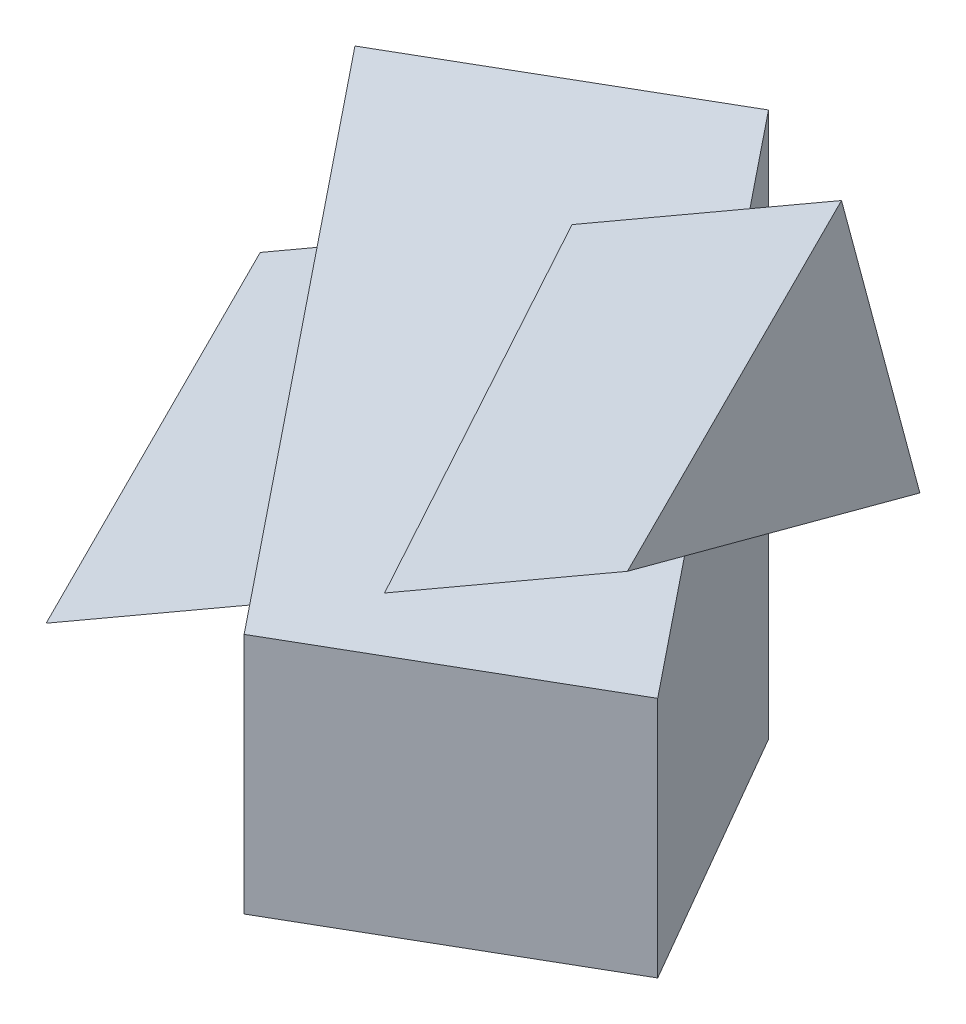
ISO-10303-21;
HEADER;
FILE_DESCRIPTION(('STEP AP214'),'2;1');
FILE_NAME('part.step','',(''),(''),'','','');
FILE_SCHEMA(('AUTOMOTIVE_DESIGN { 1 0 10303 214 1 1 1 1 }'));
ENDSEC;
DATA;
#1=APPLICATION_CONTEXT('core data for automotive mechanical design processes');
#2=APPLICATION_PROTOCOL_DEFINITION('international standard','automotive_design',2000,#1);
#3=PRODUCT_CONTEXT('',#1,'mechanical');
#4=PRODUCT('Part','Part','',(#3));
#5=PRODUCT_RELATED_PRODUCT_CATEGORY('part','',(#4));
#6=PRODUCT_DEFINITION_FORMATION('','',#4);
#7=PRODUCT_DEFINITION_CONTEXT('part definition',#1,'design');
#8=PRODUCT_DEFINITION('design','',#6,#7);
#9=PRODUCT_DEFINITION_SHAPE('','',#8);
#10=(LENGTH_UNIT() NAMED_UNIT(*) SI_UNIT(.MILLI.,.METRE.));
#11=(NAMED_UNIT(*) PLANE_ANGLE_UNIT() SI_UNIT($,.RADIAN.));
#12=(NAMED_UNIT(*) SI_UNIT($,.STERADIAN.) SOLID_ANGLE_UNIT());
#13=UNCERTAINTY_MEASURE_WITH_UNIT(LENGTH_MEASURE(1.E-05),#10,'distance_accuracy_value','');
#14=(GEOMETRIC_REPRESENTATION_CONTEXT(3) GLOBAL_UNCERTAINTY_ASSIGNED_CONTEXT((#13)) GLOBAL_UNIT_ASSIGNED_CONTEXT((#10,
#11,#12)) REPRESENTATION_CONTEXT('',''));
#15=CARTESIAN_POINT('',(0.,0.,0.));
#16=DIRECTION('',(0.,0.,1.));
#17=DIRECTION('',(1.,0.,0.));
#18=AXIS2_PLACEMENT_3D('',#15,#16,#17);
#19=CARTESIAN_POINT('',(63.3012701892223,90.,0.));
#20=DIRECTION('',(-0.866025403784445,0.,0.499999999999989));
#21=DIRECTION('',(0.499999999999989,0.,0.866025403784445));
#22=AXIS2_PLACEMENT_3D('',#19,#20,#21);
#23=PLANE('',#22);
#24=DIRECTION('',(-0.443476552470608,-0.461859491225528,-0.768123920844599));
#25=VECTOR('',#24,1.);
#26=CARTESIAN_POINT('',(74.6725165198079,46.325408780915,19.6955763899561));
#27=LINE('',#26,#25);
#28=CARTESIAN_POINT('',(81.5547883274849,53.4929637234735,31.6160208323519));
#29=VERTEX_POINT('',#28);
#30=CARTESIAN_POINT('',(67.7490084725809,39.1149082789746,7.70370868554658));
#31=VERTEX_POINT('',#30);
#32=EDGE_CURVE('E144',#29,#31,#27,.T.);
#33=ORIENTED_EDGE('',*,*,#32,.F.);
#34=DIRECTION('',(0.353553390593266,-0.707106781186548,0.612372435695799));
#35=VECTOR('',#34,1.);
#36=CARTESIAN_POINT('',(63.3012701892222,89.9999999999998,-1.44901625366124E-13));
#37=LINE('',#36,#35);
#38=CARTESIAN_POINT('',(88.3012701892215,40.,43.3012701892219));
#39=VERTEX_POINT('',#38);
#40=EDGE_CURVE('E169',#29,#39,#37,.T.);
#41=ORIENTED_EDGE('',*,*,#40,.T.);
#42=DIRECTION('',(0.,-1.,0.));
#43=VECTOR('',#42,1.);
#44=CARTESIAN_POINT('',(88.3012701892217,90.,43.3012701892223));
#45=LINE('',#44,#43);
#46=CARTESIAN_POINT('',(88.3012701892217,0.,43.3012701892223));
#47=VERTEX_POINT('',#46);
#48=EDGE_CURVE('E175',#39,#47,#45,.T.);
#49=ORIENTED_EDGE('',*,*,#48,.T.);
#50=DIRECTION('',(-0.499999999999989,0.,-0.866025403784445));
#51=VECTOR('',#50,1.);
#52=CARTESIAN_POINT('',(63.3012701892223,0.,0.));
#53=LINE('',#52,#51);
#54=CARTESIAN_POINT('',(63.3012701892223,0.,0.));
#55=VERTEX_POINT('',#54);
#56=EDGE_CURVE('E172',#47,#55,#53,.T.);
#57=ORIENTED_EDGE('',*,*,#56,.T.);
#58=DIRECTION('',(0.,-1.,0.));
#59=VECTOR('',#58,1.);
#60=CARTESIAN_POINT('',(63.3012701892223,90.,0.));
#61=LINE('',#60,#59);
#62=CARTESIAN_POINT('',(63.3012701892223,90.,0.));
#63=VERTEX_POINT('',#62);
#64=EDGE_CURVE('E193',#63,#55,#61,.T.);
#65=ORIENTED_EDGE('',*,*,#64,.F.);
#66=CARTESIAN_POINT('',(72.3931315284246,71.8162773215945,15.7475657748702));
#67=VERTEX_POINT('',#66);
#68=EDGE_CURVE('E170',#63,#67,#37,.T.);
#69=ORIENTED_EDGE('',*,*,#68,.T.);
#70=DIRECTION('',(0.136612474868475,0.961950168585274,0.236619747419932));
#71=VECTOR('',#70,1.);
#72=CARTESIAN_POINT('',(74.1040099314093,83.8633452761459,18.710894094412));
#73=LINE('',#72,#71);
#74=EDGE_CURVE('E47',#31,#67,#73,.T.);
#75=ORIENTED_EDGE('',*,*,#74,.F.);
#76=EDGE_LOOP('',(#33,#41,#49,#57,#65,#69,#75));
#77=FACE_BOUND('',#76,.T.);
#78=ADVANCED_FACE('F33',(#77),#23,.F.);
#79=CARTESIAN_POINT('',(63.3012701892223,90.,0.));
#80=DIRECTION('',(0.499999999999989,0.,0.866025403784445));
#81=DIRECTION('',(0.866025403784445,0.,-0.499999999999989));
#82=AXIS2_PLACEMENT_3D('',#79,#80,#81);
#83=PLANE('',#82);
#84=DIRECTION('',(-0.813259170127467,-0.343723769333444,0.469535400794011));
#85=VECTOR('',#84,1.);
#86=CARTESIAN_POINT('',(78.8203535776659,41.0419392793252,-8.95994697189392));
#87=LINE('',#86,#85);
#88=CARTESIAN_POINT('',(49.9580553391456,28.8432966982458,7.70370868554658));
#89=VERTEX_POINT('',#88);
#90=CARTESIAN_POINT('',(20.,16.1815326735535,24.9999999999995));
#91=VERTEX_POINT('',#90);
#92=EDGE_CURVE('E55',#89,#91,#87,.T.);
#93=ORIENTED_EDGE('',*,*,#92,.F.);
#94=DIRECTION('',(0.511552974070653,-0.806898221355063,-0.295345247284436));
#95=VECTOR('',#94,1.);
#96=CARTESIAN_POINT('',(29.3699817359462,61.3179001383467,19.5902385224492));
#97=LINE('',#96,#95);
#98=CARTESIAN_POINT('',(27.5436685349435,64.1986357575728,20.6446609406727));
#99=VERTEX_POINT('',#98);
#100=EDGE_CURVE('E157',#99,#89,#97,.T.);
#101=ORIENTED_EDGE('',*,*,#100,.F.);
#102=DIRECTION('',(0.612372435695802,0.707106781186544,-0.353553390593268));
#103=VECTOR('',#102,1.);
#104=CARTESIAN_POINT('',(56.5947878052018,97.7439788194594,3.87198940972958));
#105=LINE('',#104,#103);
#106=CARTESIAN_POINT('',(20.,55.4879576389191,24.9999999999995));
#107=VERTEX_POINT('',#106);
#108=EDGE_CURVE('E149',#107,#99,#105,.T.);
#109=ORIENTED_EDGE('',*,*,#108,.F.);
#110=DIRECTION('',(0.,-1.,0.));
#111=VECTOR('',#110,1.);
#112=CARTESIAN_POINT('',(20.,90.,24.9999999999995));
#113=LINE('',#112,#111);
#114=CARTESIAN_POINT('',(20.0000000000002,90.,24.9999999999993));
#115=VERTEX_POINT('',#114);
#116=EDGE_CURVE('E191',#115,#107,#113,.T.);
#117=ORIENTED_EDGE('',*,*,#116,.F.);
#118=DIRECTION('',(-0.866025403784445,0.,0.499999999999989));
#119=VECTOR('',#118,1.);
#120=CARTESIAN_POINT('',(63.3012701892223,90.,0.));
#121=LINE('',#120,#119);
#122=EDGE_CURVE('E173',#63,#115,#121,.T.);
#123=ORIENTED_EDGE('',*,*,#122,.F.);
#124=ORIENTED_EDGE('',*,*,#64,.T.);
#125=DIRECTION('',(-0.866025403784445,0.,0.499999999999989));
#126=VECTOR('',#125,1.);
#127=CARTESIAN_POINT('',(63.3012701892223,0.,0.));
#128=LINE('',#127,#126);
#129=CARTESIAN_POINT('',(20.,0.,24.9999999999995));
#130=VERTEX_POINT('',#129);
#131=EDGE_CURVE('E179',#55,#130,#128,.T.);
#132=ORIENTED_EDGE('',*,*,#131,.T.);
#133=EDGE_CURVE('E190',#91,#130,#113,.T.);
#134=ORIENTED_EDGE('',*,*,#133,.F.);
#135=EDGE_LOOP('',(#93,#101,#109,#117,#123,#124,#132,#134));
#136=FACE_BOUND('',#135,.T.);
#137=ADVANCED_FACE('F227',(#136),#83,.F.);
#138=CARTESIAN_POINT('',(20.,90.,24.9999999999995));
#139=DIRECTION('',(0.866025403784445,0.,-0.499999999999989));
#140=DIRECTION('',(-0.499999999999989,0.,-0.866025403784445));
#141=AXIS2_PLACEMENT_3D('',#138,#139,#140);
#142=PLANE('',#141);
#143=DIRECTION('',(0.443476552470607,0.461859491225528,0.7681239208446));
#144=VECTOR('',#143,1.);
#145=CARTESIAN_POINT('',(35.1197830402084,31.9280592113999,51.1882324250594));
#146=LINE('',#145,#144);
#147=CARTESIAN_POINT('',(37.8978583448782,34.8212909722516,56.));
#148=VERTEX_POINT('',#147);
#149=EDGE_CURVE('E160',#91,#148,#146,.T.);
#150=ORIENTED_EDGE('',*,*,#149,.F.);
#151=ORIENTED_EDGE('',*,*,#133,.T.);
#152=DIRECTION('',(0.499999999999989,0.,0.866025403784445));
#153=VECTOR('',#152,1.);
#154=CARTESIAN_POINT('',(20.,0.,24.9999999999995));
#155=LINE('',#154,#153);
#156=CARTESIAN_POINT('',(44.9999999999994,0.,68.3012701892217));
#157=VERTEX_POINT('',#156);
#158=EDGE_CURVE('E182',#130,#157,#155,.T.);
#159=ORIENTED_EDGE('',*,*,#158,.T.);
#160=DIRECTION('',(0.,-1.,0.));
#161=VECTOR('',#160,1.);
#162=CARTESIAN_POINT('',(44.9999999999994,90.,68.3012701892217));
#163=LINE('',#162,#161);
#164=CARTESIAN_POINT('',(45.,40.,68.3012701892214));
#165=VERTEX_POINT('',#164);
#166=EDGE_CURVE('E188',#165,#157,#163,.T.);
#167=ORIENTED_EDGE('',*,*,#166,.F.);
#168=DIRECTION('',(0.35355339059327,-0.707106781186547,0.612372435695796));
#169=VECTOR('',#168,1.);
#170=CARTESIAN_POINT('',(45.,40.,68.3012701892214));
#171=LINE('',#170,#169);
#172=EDGE_CURVE('E164',#115,#165,#171,.T.);
#173=ORIENTED_EDGE('',*,*,#172,.F.);
#174=ORIENTED_EDGE('',*,*,#116,.T.);
#175=DIRECTION('',(-0.433012701892207,0.50000000000001,-0.75));
#176=VECTOR('',#175,1.);
#177=CARTESIAN_POINT('',(12.5279236447049,64.1159682291896,12.0579841145938));
#178=LINE('',#177,#176);
#179=EDGE_CURVE('E145',#148,#107,#178,.T.);
#180=ORIENTED_EDGE('',*,*,#179,.F.);
#181=EDGE_LOOP('',(#150,#151,#159,#167,#173,#174,#180));
#182=FACE_BOUND('',#181,.T.);
#183=ADVANCED_FACE('F231',(#182),#142,.F.);
#184=CARTESIAN_POINT('',(107.051270189222,40.,32.4759526419166));
#185=DIRECTION('',(-0.353553390593271,-0.707106781186547,-0.612372435695796));
#186=DIRECTION('',(0.,0.654653670707978,-0.755928946018454));
#187=AXIS2_PLACEMENT_3D('',#184,#185,#186);
#188=PLANE('',#187);
#189=DIRECTION('',(0.705905608282404,0.227852886799724,-0.670656644023215));
#190=VECTOR('',#189,1.);
#191=CARTESIAN_POINT('',(91.6824018445503,56.7619644923866,21.9941234941996));
#192=LINE('',#191,#190);
#193=CARTESIAN_POINT('',(55.8892144454072,45.2086052599784,56.));
#194=VERTEX_POINT('',#193);
#195=EDGE_CURVE('E11',#194,#29,#192,.T.);
#196=ORIENTED_EDGE('',*,*,#195,.F.);
#197=DIRECTION('',(0.0907675134870607,-0.67749794402081,0.729902592366236));
#198=VECTOR('',#197,1.);
#199=CARTESIAN_POINT('',(55.0725254639018,51.3044548058982,49.4326348507639));
#200=LINE('',#199,#198);
#201=CARTESIAN_POINT('',(51.4925781702796,78.025545182332,20.6446609406727));
#202=VERTEX_POINT('',#201);
#203=EDGE_CURVE('E196',#202,#194,#200,.T.);
#204=ORIENTED_EDGE('',*,*,#203,.F.);
#205=DIRECTION('',(-0.935290880822453,0.277862098061081,0.219142927587122));
#206=VECTOR('',#205,1.);
#207=CARTESIAN_POINT('',(107.550782081473,61.3714213459028,7.50996758241808));
#208=LINE('',#207,#206);
#209=EDGE_CURVE('E40',#67,#202,#208,.T.);
#210=ORIENTED_EDGE('',*,*,#209,.F.);
#211=ORIENTED_EDGE('',*,*,#68,.F.);
#212=ORIENTED_EDGE('',*,*,#122,.T.);
#213=ORIENTED_EDGE('',*,*,#172,.T.);
#214=DIRECTION('',(-0.866025403784441,0.,0.499999999999995));
#215=VECTOR('',#214,1.);
#216=CARTESIAN_POINT('',(107.051270189222,40.,32.4759526419166));
#217=LINE('',#216,#215);
#218=EDGE_CURVE('E166',#39,#165,#217,.T.);
#219=ORIENTED_EDGE('',*,*,#218,.F.);
#220=ORIENTED_EDGE('',*,*,#40,.F.);
#221=EDGE_LOOP('',(#196,#204,#210,#211,#212,#213,#219,#220));
#222=FACE_BOUND('',#221,.T.);
#223=ADVANCED_FACE('F246',(#222),#188,.F.);
#224=CARTESIAN_POINT('',(88.3012701892217,90.,43.3012701892223));
#225=DIRECTION('',(-0.499999999999989,0.,-0.866025403784445));
#226=DIRECTION('',(-0.866025403784445,0.,0.499999999999989));
#227=AXIS2_PLACEMENT_3D('',#224,#225,#226);
#228=PLANE('',#227);
#229=ORIENTED_EDGE('',*,*,#48,.F.);
#230=ORIENTED_EDGE('',*,*,#218,.T.);
#231=ORIENTED_EDGE('',*,*,#166,.T.);
#232=DIRECTION('',(0.866025403784445,0.,-0.499999999999989));
#233=VECTOR('',#232,1.);
#234=CARTESIAN_POINT('',(88.3012701892217,0.,43.3012701892223));
#235=LINE('',#234,#233);
#236=EDGE_CURVE('E176',#157,#47,#235,.T.);
#237=ORIENTED_EDGE('',*,*,#236,.T.);
#238=EDGE_LOOP('',(#229,#230,#231,#237));
#239=FACE_BOUND('',#238,.T.);
#240=ADVANCED_FACE('F243',(#239),#228,.F.);
#241=CARTESIAN_POINT('',(0.,0.,0.));
#242=DIRECTION('',(0.,-1.,0.));
#243=DIRECTION('',(0.,0.,-1.));
#244=AXIS2_PLACEMENT_3D('',#241,#242,#243);
#245=PLANE('',#244);
#246=ORIENTED_EDGE('',*,*,#56,.F.);
#247=ORIENTED_EDGE('',*,*,#236,.F.);
#248=ORIENTED_EDGE('',*,*,#158,.F.);
#249=ORIENTED_EDGE('',*,*,#131,.F.);
#250=EDGE_LOOP('',(#246,#247,#248,#249));
#251=FACE_BOUND('',#250,.T.);
#252=ADVANCED_FACE('F240',(#251),#245,.T.);
#253=CARTESIAN_POINT('',(96.,55.4256258422038,0.));
#254=DIRECTION('',(1.,0.,0.));
#255=DIRECTION('',(0.,0.,-1.));
#256=AXIS2_PLACEMENT_3D('',#253,#254,#255);
#257=PLANE('',#256);
#258=DIRECTION('',(0.,-0.25881904510252,-0.965925826289069));
#259=VECTOR('',#258,1.);
#260=CARTESIAN_POINT('',(96.,68.3665780973298,56.));
#261=LINE('',#260,#259);
#262=CARTESIAN_POINT('',(96.,68.3665780973298,56.));
#263=VERTEX_POINT('',#262);
#264=CARTESIAN_POINT('',(96.,55.4256258422038,7.70370868554658));
#265=VERTEX_POINT('',#264);
#266=EDGE_CURVE('E134',#263,#265,#261,.T.);
#267=ORIENTED_EDGE('',*,*,#266,.T.);
#268=DIRECTION('',(0.,0.965925826289068,0.258819045102522));
#269=VECTOR('',#268,1.);
#270=CARTESIAN_POINT('',(96.,55.4256258422038,7.70370868554658));
#271=LINE('',#270,#269);
#272=CARTESIAN_POINT('',(96.,103.721917156657,20.6446609406727));
#273=VERTEX_POINT('',#272);
#274=EDGE_CURVE('E123',#265,#273,#271,.T.);
#275=ORIENTED_EDGE('',*,*,#274,.T.);
#276=DIRECTION('',(0.,-0.707106781186548,0.707106781186547));
#277=VECTOR('',#276,1.);
#278=CARTESIAN_POINT('',(96.,103.721917156657,20.6446609406727));
#279=LINE('',#278,#277);
#280=EDGE_CURVE('E133',#273,#263,#279,.T.);
#281=ORIENTED_EDGE('',*,*,#280,.T.);
#282=EDGE_LOOP('',(#267,#275,#281));
#283=FACE_BOUND('',#282,.T.);
#284=ADVANCED_FACE('F137',(#283),#257,.T.);
#285=CARTESIAN_POINT('',(96.,103.721917156657,20.6446609406727));
#286=DIRECTION('',(0.377964473009225,-0.654653670707977,-0.654653670707978));
#287=DIRECTION('',(0.,0.707106781186548,-0.707106781186547));
#288=AXIS2_PLACEMENT_3D('',#285,#286,#287);
#289=PLANE('',#288);
#290=DIRECTION('',(-0.86602540378444,-0.499999999999998,0.));
#291=VECTOR('',#290,1.);
#292=CARTESIAN_POINT('',(96.,103.721917156657,20.6446609406727));
#293=LINE('',#292,#291);
#294=EDGE_CURVE('E130',#273,#202,#293,.T.);
#295=ORIENTED_EDGE('',*,*,#294,.T.);
#296=ORIENTED_EDGE('',*,*,#203,.T.);
#297=DIRECTION('',(-0.86602540378444,-0.499999999999998,0.));
#298=VECTOR('',#297,1.);
#299=CARTESIAN_POINT('',(96.,68.3665780973298,56.));
#300=LINE('',#299,#298);
#301=EDGE_CURVE('E202',#263,#194,#300,.T.);
#302=ORIENTED_EDGE('',*,*,#301,.F.);
#303=ORIENTED_EDGE('',*,*,#280,.F.);
#304=EDGE_LOOP('',(#295,#296,#302,#303));
#305=FACE_BOUND('',#304,.T.);
#306=ADVANCED_FACE('F200',(#305),#289,.F.);
#307=CARTESIAN_POINT('',(96.,55.4256258422038,7.70370868554658));
#308=DIRECTION('',(0.14778836410782,-0.255976955402234,0.955319003127927));
#309=DIRECTION('',(0.,-0.965925826289068,-0.258819045102522));
#310=AXIS2_PLACEMENT_3D('',#307,#308,#309);
#311=PLANE('',#310);
#312=DIRECTION('',(-0.86602540378444,-0.499999999999998,0.));
#313=VECTOR('',#312,1.);
#314=CARTESIAN_POINT('',(96.,55.4256258422038,7.70370868554658));
#315=LINE('',#314,#313);
#316=EDGE_CURVE('E127',#265,#31,#315,.T.);
#317=ORIENTED_EDGE('',*,*,#316,.T.);
#318=ORIENTED_EDGE('',*,*,#74,.T.);
#319=ORIENTED_EDGE('',*,*,#209,.T.);
#320=ORIENTED_EDGE('',*,*,#294,.F.);
#321=ORIENTED_EDGE('',*,*,#274,.F.);
#322=EDGE_LOOP('',(#317,#318,#319,#320,#321));
#323=FACE_BOUND('',#322,.T.);
#324=ADVANCED_FACE('F125',(#323),#311,.F.);
#325=CARTESIAN_POINT('',(96.,68.3665780973298,56.));
#326=DIRECTION('',(-0.487058473848147,0.843610022961952,-0.226044624379455));
#327=DIRECTION('',(-0.86602540378444,-0.499999999999998,0.));
#328=AXIS2_PLACEMENT_3D('',#325,#326,#327);
#329=PLANE('',#328);
#330=ORIENTED_EDGE('',*,*,#195,.T.);
#331=ORIENTED_EDGE('',*,*,#32,.T.);
#332=ORIENTED_EDGE('',*,*,#316,.F.);
#333=ORIENTED_EDGE('',*,*,#266,.F.);
#334=ORIENTED_EDGE('',*,*,#301,.T.);
#335=EDGE_LOOP('',(#330,#331,#332,#333,#334));
#336=FACE_BOUND('',#335,.T.);
#337=ADVANCED_FACE('F143',(#336),#329,.F.);
#338=CARTESIAN_POINT('',(0.,0.,7.70370868554658));
#339=VERTEX_POINT('',#338);
#340=EDGE_CURVE('E146',#89,#339,#315,.T.);
#341=ORIENTED_EDGE('',*,*,#340,.F.);
#342=ORIENTED_EDGE('',*,*,#92,.T.);
#343=ORIENTED_EDGE('',*,*,#149,.T.);
#344=CARTESIAN_POINT('',(0.,12.940952255126,56.));
#345=VERTEX_POINT('',#344);
#346=EDGE_CURVE('E207',#148,#345,#300,.T.);
#347=ORIENTED_EDGE('',*,*,#346,.T.);
#348=DIRECTION('',(0.,-0.25881904510252,-0.965925826289069));
#349=VECTOR('',#348,1.);
#350=CARTESIAN_POINT('',(0.,12.940952255126,56.));
#351=LINE('',#350,#349);
#352=EDGE_CURVE('E212',#345,#339,#351,.T.);
#353=ORIENTED_EDGE('',*,*,#352,.T.);
#354=EDGE_LOOP('',(#341,#342,#343,#347,#353));
#355=FACE_BOUND('',#354,.T.);
#356=ADVANCED_FACE('F218',(#355),#329,.F.);
#357=CARTESIAN_POINT('',(0.,48.2962913144534,20.6446609406727));
#358=VERTEX_POINT('',#357);
#359=EDGE_CURVE('E201',#99,#358,#293,.T.);
#360=ORIENTED_EDGE('',*,*,#359,.F.);
#361=ORIENTED_EDGE('',*,*,#100,.T.);
#362=ORIENTED_EDGE('',*,*,#340,.T.);
#363=DIRECTION('',(0.,0.965925826289068,0.258819045102522));
#364=VECTOR('',#363,1.);
#365=CARTESIAN_POINT('',(0.,0.,7.70370868554658));
#366=LINE('',#365,#364);
#367=EDGE_CURVE('E210',#339,#358,#366,.T.);
#368=ORIENTED_EDGE('',*,*,#367,.T.);
#369=EDGE_LOOP('',(#360,#361,#362,#368));
#370=FACE_BOUND('',#369,.T.);
#371=ADVANCED_FACE('F225',(#370),#311,.F.);
#372=ORIENTED_EDGE('',*,*,#179,.T.);
#373=ORIENTED_EDGE('',*,*,#108,.T.);
#374=ORIENTED_EDGE('',*,*,#359,.T.);
#375=DIRECTION('',(0.,-0.707106781186548,0.707106781186547));
#376=VECTOR('',#375,1.);
#377=CARTESIAN_POINT('',(0.,48.2962913144534,20.6446609406727));
#378=LINE('',#377,#376);
#379=EDGE_CURVE('E141',#358,#345,#378,.T.);
#380=ORIENTED_EDGE('',*,*,#379,.T.);
#381=ORIENTED_EDGE('',*,*,#346,.F.);
#382=EDGE_LOOP('',(#372,#373,#374,#380,#381));
#383=FACE_BOUND('',#382,.T.);
#384=ADVANCED_FACE('F229',(#383),#289,.F.);
#385=CARTESIAN_POINT('',(0.,0.,0.));
#386=DIRECTION('',(1.,0.,0.));
#387=DIRECTION('',(0.,0.,-1.));
#388=AXIS2_PLACEMENT_3D('',#385,#386,#387);
#389=PLANE('',#388);
#390=ORIENTED_EDGE('',*,*,#352,.F.);
#391=ORIENTED_EDGE('',*,*,#379,.F.);
#392=ORIENTED_EDGE('',*,*,#367,.F.);
#393=EDGE_LOOP('',(#390,#391,#392));
#394=FACE_BOUND('',#393,.T.);
#395=ADVANCED_FACE('F223',(#394),#389,.F.);
#396=CLOSED_SHELL('',(#78,#137,#183,#223,#240,#252,#284,#306,#324,#337,#356,#371,#384,#395));
#397=MANIFOLD_SOLID_BREP('B2',#396);
#398=ADVANCED_BREP_SHAPE_REPRESENTATION('',(#18,#397),#14);
#399=SHAPE_DEFINITION_REPRESENTATION(#9,#398);
ENDSEC;
END-ISO-10303-21;
